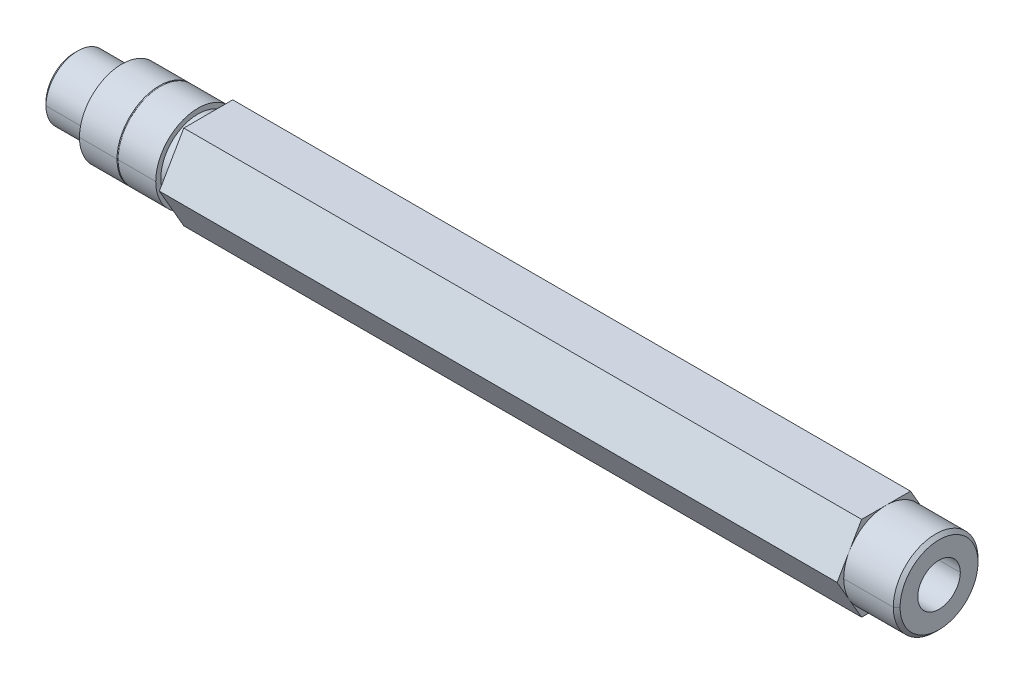
ISO-10303-21;
HEADER;
FILE_DESCRIPTION(('STEP AP214'),'2;1');
FILE_NAME('part.step','',(''),(''),'','','');
FILE_SCHEMA(('AUTOMOTIVE_DESIGN { 1 0 10303 214 1 1 1 1 }'));
ENDSEC;
DATA;
#1=APPLICATION_CONTEXT('core data for automotive mechanical design processes');
#2=APPLICATION_PROTOCOL_DEFINITION('international standard','automotive_design',2000,#1);
#3=PRODUCT_CONTEXT('',#1,'mechanical');
#4=PRODUCT('Part','Part','',(#3));
#5=PRODUCT_RELATED_PRODUCT_CATEGORY('part','',(#4));
#6=PRODUCT_DEFINITION_FORMATION('','',#4);
#7=PRODUCT_DEFINITION_CONTEXT('part definition',#1,'design');
#8=PRODUCT_DEFINITION('design','',#6,#7);
#9=PRODUCT_DEFINITION_SHAPE('','',#8);
#10=(LENGTH_UNIT() NAMED_UNIT(*) SI_UNIT(.MILLI.,.METRE.));
#11=(NAMED_UNIT(*) PLANE_ANGLE_UNIT() SI_UNIT($,.RADIAN.));
#12=(NAMED_UNIT(*) SI_UNIT($,.STERADIAN.) SOLID_ANGLE_UNIT());
#13=UNCERTAINTY_MEASURE_WITH_UNIT(LENGTH_MEASURE(1.E-05),#10,'distance_accuracy_value','');
#14=(GEOMETRIC_REPRESENTATION_CONTEXT(3) GLOBAL_UNCERTAINTY_ASSIGNED_CONTEXT((#13)) GLOBAL_UNIT_ASSIGNED_CONTEXT((#10,
#11,#12)) REPRESENTATION_CONTEXT('',''));
#15=CARTESIAN_POINT('',(0.,0.,0.));
#16=DIRECTION('',(0.,0.,1.));
#17=DIRECTION('',(1.,0.,0.));
#18=AXIS2_PLACEMENT_3D('',#15,#16,#17);
#19=CARTESIAN_POINT('',(18.542,0.,0.));
#20=DIRECTION('',(-1.,0.,0.));
#21=DIRECTION('',(0.,0.,1.));
#22=AXIS2_PLACEMENT_3D('',#19,#20,#21);
#23=CYLINDRICAL_SURFACE('',#22,6.35);
#24=DIRECTION('',(-1.,0.,0.));
#25=VECTOR('',#24,1.);
#26=CARTESIAN_POINT('',(18.542,0.,-6.35));
#27=LINE('',#26,#25);
#28=CARTESIAN_POINT('',(12.7381,0.,-6.35));
#29=VERTEX_POINT('',#28);
#30=CARTESIAN_POINT('',(7.112,0.,-6.35));
#31=VERTEX_POINT('',#30);
#32=EDGE_CURVE('E277',#29,#31,#27,.T.);
#33=ORIENTED_EDGE('',*,*,#32,.F.);
#34=CARTESIAN_POINT('',(12.7381,0.,0.));
#35=DIRECTION('',(1.,0.,0.));
#36=DIRECTION('',(0.,0.,-1.));
#37=AXIS2_PLACEMENT_3D('',#34,#35,#36);
#38=CIRCLE('',#37,6.35);
#39=CARTESIAN_POINT('',(12.7381,0.,6.35));
#40=VERTEX_POINT('',#39);
#41=EDGE_CURVE('E276',#40,#29,#38,.T.);
#42=ORIENTED_EDGE('',*,*,#41,.F.);
#43=DIRECTION('',(-1.,0.,0.));
#44=VECTOR('',#43,1.);
#45=CARTESIAN_POINT('',(18.542,0.,6.35));
#46=LINE('',#45,#44);
#47=CARTESIAN_POINT('',(7.112,0.,6.35));
#48=VERTEX_POINT('',#47);
#49=EDGE_CURVE('E262',#40,#48,#46,.T.);
#50=ORIENTED_EDGE('',*,*,#49,.T.);
#51=CARTESIAN_POINT('',(7.112,0.,0.));
#52=DIRECTION('',(1.,0.,0.));
#53=DIRECTION('',(0.,0.,-1.));
#54=AXIS2_PLACEMENT_3D('',#51,#52,#53);
#55=CIRCLE('',#54,6.35);
#56=EDGE_CURVE('E11',#48,#31,#55,.T.);
#57=ORIENTED_EDGE('',*,*,#56,.T.);
#58=EDGE_LOOP('',(#33,#42,#50,#57));
#59=FACE_BOUND('',#58,.T.);
#60=ADVANCED_FACE('F16',(#59),#23,.T.);
#61=CARTESIAN_POINT('',(7.112,0.,0.));
#62=DIRECTION('',(1.,0.,0.));
#63=DIRECTION('',(0.,1.,0.));
#64=AXIS2_PLACEMENT_3D('',#61,#62,#63);
#65=PLANE('',#64);
#66=CARTESIAN_POINT('',(7.112,0.,0.));
#67=DIRECTION('',(1.,0.,0.));
#68=DIRECTION('',(0.,0.,-1.));
#69=AXIS2_PLACEMENT_3D('',#66,#67,#68);
#70=CIRCLE('',#69,4.7625);
#71=CARTESIAN_POINT('',(7.112,0.,4.7625));
#72=VERTEX_POINT('',#71);
#73=CARTESIAN_POINT('',(7.112,0.,-4.7625));
#74=VERTEX_POINT('',#73);
#75=EDGE_CURVE('E26',#72,#74,#70,.T.);
#76=ORIENTED_EDGE('',*,*,#75,.T.);
#77=CARTESIAN_POINT('',(7.112,0.,0.));
#78=DIRECTION('',(1.,0.,0.));
#79=DIRECTION('',(0.,0.,-1.));
#80=AXIS2_PLACEMENT_3D('',#77,#78,#79);
#81=CIRCLE('',#80,4.7625);
#82=EDGE_CURVE('E273',#74,#72,#81,.T.);
#83=ORIENTED_EDGE('',*,*,#82,.T.);
#84=EDGE_LOOP('',(#76,#83));
#85=FACE_BOUND('',#84,.T.);
#86=ORIENTED_EDGE('',*,*,#56,.F.);
#87=CARTESIAN_POINT('',(7.112,0.,0.));
#88=DIRECTION('',(1.,0.,0.));
#89=DIRECTION('',(0.,0.,-1.));
#90=AXIS2_PLACEMENT_3D('',#87,#88,#89);
#91=CIRCLE('',#90,6.35);
#92=EDGE_CURVE('E270',#31,#48,#91,.T.);
#93=ORIENTED_EDGE('',*,*,#92,.F.);
#94=EDGE_LOOP('',(#86,#93));
#95=FACE_BOUND('',#94,.T.);
#96=ADVANCED_FACE('F629',(#85,#95),#65,.F.);
#97=CARTESIAN_POINT('',(7.112,0.,0.));
#98=DIRECTION('',(-1.,0.,0.));
#99=DIRECTION('',(0.,0.,1.));
#100=AXIS2_PLACEMENT_3D('',#97,#98,#99);
#101=CYLINDRICAL_SURFACE('',#100,4.7625);
#102=DIRECTION('',(-1.,0.,0.));
#103=VECTOR('',#102,1.);
#104=CARTESIAN_POINT('',(7.112,0.,-4.7625));
#105=LINE('',#104,#103);
#106=CARTESIAN_POINT('',(0.50800000000003,0.,-4.7625));
#107=VERTEX_POINT('',#106);
#108=EDGE_CURVE('E346',#74,#107,#105,.T.);
#109=ORIENTED_EDGE('',*,*,#108,.F.);
#110=ORIENTED_EDGE('',*,*,#75,.F.);
#111=DIRECTION('',(-1.,0.,0.));
#112=VECTOR('',#111,1.);
#113=CARTESIAN_POINT('',(7.112,0.,4.7625));
#114=LINE('',#113,#112);
#115=CARTESIAN_POINT('',(0.50800000000003,0.,4.7625));
#116=VERTEX_POINT('',#115);
#117=EDGE_CURVE('E345',#72,#116,#114,.T.);
#118=ORIENTED_EDGE('',*,*,#117,.T.);
#119=CARTESIAN_POINT('',(0.50800000000003,0.,0.));
#120=DIRECTION('',(1.,0.,0.));
#121=DIRECTION('',(0.,0.,-1.));
#122=AXIS2_PLACEMENT_3D('',#119,#120,#121);
#123=CIRCLE('',#122,4.7625);
#124=EDGE_CURVE('E311',#116,#107,#123,.T.);
#125=ORIENTED_EDGE('',*,*,#124,.T.);
#126=EDGE_LOOP('',(#109,#110,#118,#125));
#127=FACE_BOUND('',#126,.T.);
#128=ADVANCED_FACE('F635',(#127),#101,.T.);
#129=CARTESIAN_POINT('',(0.50800000000003,0.,0.));
#130=DIRECTION('',(1.,0.,0.));
#131=DIRECTION('',(0.,0.,-1.));
#132=AXIS2_PLACEMENT_3D('',#129,#130,#131);
#133=CONICAL_SURFACE('',#132,4.7625,0.785398163397452);
#134=DIRECTION('',(0.707106781186545,0.,0.70710678118655));
#135=VECTOR('',#134,1.);
#136=CARTESIAN_POINT('',(0.50800000000003,0.,4.7625));
#137=LINE('',#136,#135);
#138=CARTESIAN_POINT('',(0.,0.,4.2545));
#139=VERTEX_POINT('',#138);
#140=EDGE_CURVE('E324',#139,#116,#137,.T.);
#141=ORIENTED_EDGE('',*,*,#140,.F.);
#142=CARTESIAN_POINT('',(0.,0.,0.));
#143=DIRECTION('',(-1.,0.,0.));
#144=DIRECTION('',(0.,0.,-1.));
#145=AXIS2_PLACEMENT_3D('',#142,#143,#144);
#146=CIRCLE('',#145,4.2545);
#147=CARTESIAN_POINT('',(0.,0.,-4.2545));
#148=VERTEX_POINT('',#147);
#149=EDGE_CURVE('E378',#148,#139,#146,.T.);
#150=ORIENTED_EDGE('',*,*,#149,.F.);
#151=DIRECTION('',(0.707106781186545,0.,-0.70710678118655));
#152=VECTOR('',#151,1.);
#153=CARTESIAN_POINT('',(0.50800000000003,0.,-4.7625));
#154=LINE('',#153,#152);
#155=EDGE_CURVE('E327',#148,#107,#154,.T.);
#156=ORIENTED_EDGE('',*,*,#155,.T.);
#157=ORIENTED_EDGE('',*,*,#124,.F.);
#158=EDGE_LOOP('',(#141,#150,#156,#157));
#159=FACE_BOUND('',#158,.T.);
#160=ADVANCED_FACE('F644',(#159),#133,.T.);
#161=CARTESIAN_POINT('',(0.,0.,0.));
#162=DIRECTION('',(1.,0.,0.));
#163=DIRECTION('',(0.,1.,0.));
#164=AXIS2_PLACEMENT_3D('',#161,#162,#163);
#165=PLANE('',#164);
#166=CARTESIAN_POINT('',(0.,0.,0.));
#167=DIRECTION('',(-1.,0.,0.));
#168=DIRECTION('',(0.,0.,1.));
#169=AXIS2_PLACEMENT_3D('',#166,#167,#168);
#170=CIRCLE('',#169,3.1877);
#171=CARTESIAN_POINT('',(0.,0.,3.1877));
#172=VERTEX_POINT('',#171);
#173=CARTESIAN_POINT('',(0.,0.,-3.1877));
#174=VERTEX_POINT('',#173);
#175=EDGE_CURVE('E381',#172,#174,#170,.T.);
#176=ORIENTED_EDGE('',*,*,#175,.F.);
#177=CARTESIAN_POINT('',(0.,0.,0.));
#178=DIRECTION('',(-1.,0.,0.));
#179=DIRECTION('',(0.,0.,1.));
#180=AXIS2_PLACEMENT_3D('',#177,#178,#179);
#181=CIRCLE('',#180,3.1877);
#182=EDGE_CURVE('E426',#174,#172,#181,.T.);
#183=ORIENTED_EDGE('',*,*,#182,.F.);
#184=EDGE_LOOP('',(#176,#183));
#185=FACE_BOUND('',#184,.T.);
#186=ORIENTED_EDGE('',*,*,#149,.T.);
#187=CARTESIAN_POINT('',(0.,0.,0.));
#188=DIRECTION('',(-1.,0.,0.));
#189=DIRECTION('',(0.,0.,-1.));
#190=AXIS2_PLACEMENT_3D('',#187,#188,#189);
#191=CIRCLE('',#190,4.2545);
#192=EDGE_CURVE('E328',#139,#148,#191,.T.);
#193=ORIENTED_EDGE('',*,*,#192,.T.);
#194=EDGE_LOOP('',(#186,#193));
#195=FACE_BOUND('',#194,.T.);
#196=ADVANCED_FACE('F18',(#185,#195),#165,.F.);
#197=CARTESIAN_POINT('',(0.,0.,0.));
#198=DIRECTION('',(-1.,0.,0.));
#199=DIRECTION('',(0.,0.,1.));
#200=AXIS2_PLACEMENT_3D('',#197,#198,#199);
#201=CYLINDRICAL_SURFACE('',#200,3.1877);
#202=DIRECTION('',(-1.,0.,0.));
#203=VECTOR('',#202,1.);
#204=CARTESIAN_POINT('',(0.,0.,-3.1877));
#205=LINE('',#204,#203);
#206=CARTESIAN_POINT('',(12.7,0.,-3.1877));
#207=VERTEX_POINT('',#206);
#208=EDGE_CURVE('E422',#207,#174,#205,.T.);
#209=ORIENTED_EDGE('',*,*,#208,.F.);
#210=CARTESIAN_POINT('',(12.7,0.,0.));
#211=DIRECTION('',(-1.,0.,0.));
#212=DIRECTION('',(0.,0.,1.));
#213=AXIS2_PLACEMENT_3D('',#210,#211,#212);
#214=CIRCLE('',#213,3.1877);
#215=CARTESIAN_POINT('',(12.7,0.,3.1877));
#216=VERTEX_POINT('',#215);
#217=EDGE_CURVE('E593',#216,#207,#214,.T.);
#218=ORIENTED_EDGE('',*,*,#217,.F.);
#219=DIRECTION('',(-1.,0.,0.));
#220=VECTOR('',#219,1.);
#221=CARTESIAN_POINT('',(0.,0.,3.1877));
#222=LINE('',#221,#220);
#223=EDGE_CURVE('E433',#216,#172,#222,.T.);
#224=ORIENTED_EDGE('',*,*,#223,.T.);
#225=ORIENTED_EDGE('',*,*,#175,.T.);
#226=EDGE_LOOP('',(#209,#218,#224,#225));
#227=FACE_BOUND('',#226,.T.);
#228=ADVANCED_FACE('F603',(#227),#201,.F.);
#229=CARTESIAN_POINT('',(12.7,0.,0.));
#230=DIRECTION('',(-1.,0.,0.));
#231=DIRECTION('',(0.,0.,1.));
#232=AXIS2_PLACEMENT_3D('',#229,#230,#231);
#233=CONICAL_SURFACE('',#232,3.1877,1.02974425867665);
#234=DIRECTION('',(-0.515038074910055,0.,-0.857167300702112));
#235=VECTOR('',#234,1.);
#236=CARTESIAN_POINT('',(12.7,0.,-3.1877));
#237=LINE('',#236,#235);
#238=CARTESIAN_POINT('',(14.6153633952742,0.,0.));
#239=VERTEX_POINT('',#238);
#240=EDGE_CURVE('E418',#239,#207,#237,.T.);
#241=ORIENTED_EDGE('',*,*,#240,.F.);
#242=DIRECTION('',(-0.515038074910055,0.,0.857167300702112));
#243=VECTOR('',#242,1.);
#244=CARTESIAN_POINT('',(12.7,0.,3.1877));
#245=LINE('',#244,#243);
#246=EDGE_CURVE('E437',#239,#216,#245,.T.);
#247=ORIENTED_EDGE('',*,*,#246,.T.);
#248=ORIENTED_EDGE('',*,*,#217,.T.);
#249=EDGE_LOOP('',(#241,#247,#248));
#250=FACE_BOUND('',#249,.T.);
#251=ADVANCED_FACE('F614',(#250),#233,.F.);
#252=CARTESIAN_POINT('',(12.827,0.,0.));
#253=DIRECTION('',(-1.,0.,0.));
#254=DIRECTION('',(0.,0.,1.));
#255=AXIS2_PLACEMENT_3D('',#252,#253,#254);
#256=TOROIDAL_SURFACE('',#255,6.35,0.0889);
#257=CARTESIAN_POINT('',(12.827,0.,0.));
#258=DIRECTION('',(-1.,0.,0.));
#259=DIRECTION('',(0.,0.,1.));
#260=AXIS2_PLACEMENT_3D('',#257,#258,#259);
#261=CIRCLE('',#260,6.2611);
#262=CARTESIAN_POINT('',(12.827,0.,6.2611));
#263=VERTEX_POINT('',#262);
#264=CARTESIAN_POINT('',(12.827,0.,-6.2611));
#265=VERTEX_POINT('',#264);
#266=EDGE_CURVE('E297',#263,#265,#261,.T.);
#267=ORIENTED_EDGE('',*,*,#266,.F.);
#268=CARTESIAN_POINT('',(12.827,0.,6.35));
#269=DIRECTION('',(0.,-1.,0.));
#270=DIRECTION('',(0.,0.,-1.));
#271=AXIS2_PLACEMENT_3D('',#268,#269,#270);
#272=CIRCLE('',#271,0.0889);
#273=CARTESIAN_POINT('',(12.9159,0.,6.35));
#274=VERTEX_POINT('',#273);
#275=EDGE_CURVE('E452',#263,#274,#272,.T.);
#276=ORIENTED_EDGE('',*,*,#275,.T.);
#277=CARTESIAN_POINT('',(12.9159,0.,0.));
#278=DIRECTION('',(-1.,0.,0.));
#279=DIRECTION('',(0.,0.,1.));
#280=AXIS2_PLACEMENT_3D('',#277,#278,#279);
#281=CIRCLE('',#280,6.35);
#282=CARTESIAN_POINT('',(12.9159,0.,-6.35));
#283=VERTEX_POINT('',#282);
#284=EDGE_CURVE('E412',#274,#283,#281,.T.);
#285=ORIENTED_EDGE('',*,*,#284,.T.);
#286=CARTESIAN_POINT('',(12.827,0.,-6.35));
#287=DIRECTION('',(0.,1.,0.));
#288=DIRECTION('',(0.,0.,1.));
#289=AXIS2_PLACEMENT_3D('',#286,#287,#288);
#290=CIRCLE('',#289,0.0889);
#291=EDGE_CURVE('E413',#265,#283,#290,.T.);
#292=ORIENTED_EDGE('',*,*,#291,.F.);
#293=EDGE_LOOP('',(#267,#276,#285,#292));
#294=FACE_BOUND('',#293,.T.);
#295=ADVANCED_FACE('F616',(#294),#256,.F.);
#296=CARTESIAN_POINT('',(129.6035,0.,0.));
#297=DIRECTION('',(1.,0.,0.));
#298=DIRECTION('',(0.,0.,-1.));
#299=AXIS2_PLACEMENT_3D('',#296,#297,#298);
#300=CYLINDRICAL_SURFACE('',#299,3.1877);
#301=DIRECTION('',(1.,0.,0.));
#302=VECTOR('',#301,1.);
#303=CARTESIAN_POINT('',(129.6035,0.,3.1877));
#304=LINE('',#303,#302);
#305=CARTESIAN_POINT('',(116.9035,0.,3.1877));
#306=VERTEX_POINT('',#305);
#307=CARTESIAN_POINT('',(129.6035,0.,3.1877));
#308=VERTEX_POINT('',#307);
#309=EDGE_CURVE('E469',#306,#308,#304,.T.);
#310=ORIENTED_EDGE('',*,*,#309,.F.);
#311=CARTESIAN_POINT('',(116.9035,0.,0.));
#312=DIRECTION('',(1.,0.,0.));
#313=DIRECTION('',(0.,0.,-1.));
#314=AXIS2_PLACEMENT_3D('',#311,#312,#313);
#315=CIRCLE('',#314,3.1877);
#316=CARTESIAN_POINT('',(116.9035,0.,-3.1877));
#317=VERTEX_POINT('',#316);
#318=EDGE_CURVE('E20',#317,#306,#315,.T.);
#319=ORIENTED_EDGE('',*,*,#318,.F.);
#320=DIRECTION('',(1.,0.,0.));
#321=VECTOR('',#320,1.);
#322=CARTESIAN_POINT('',(129.6035,0.,-3.1877));
#323=LINE('',#322,#321);
#324=CARTESIAN_POINT('',(129.6035,0.,-3.1877));
#325=VERTEX_POINT('',#324);
#326=EDGE_CURVE('E481',#317,#325,#323,.T.);
#327=ORIENTED_EDGE('',*,*,#326,.T.);
#328=CARTESIAN_POINT('',(129.6035,0.,0.));
#329=DIRECTION('',(1.,0.,0.));
#330=DIRECTION('',(0.,0.,-1.));
#331=AXIS2_PLACEMENT_3D('',#328,#329,#330);
#332=CIRCLE('',#331,3.1877);
#333=EDGE_CURVE('E460',#325,#308,#332,.T.);
#334=ORIENTED_EDGE('',*,*,#333,.T.);
#335=EDGE_LOOP('',(#310,#319,#327,#334));
#336=FACE_BOUND('',#335,.T.);
#337=ADVANCED_FACE('F623',(#336),#300,.F.);
#338=CARTESIAN_POINT('',(116.9035,0.,0.));
#339=DIRECTION('',(1.,0.,0.));
#340=DIRECTION('',(0.,0.,-1.));
#341=AXIS2_PLACEMENT_3D('',#338,#339,#340);
#342=CONICAL_SURFACE('',#341,3.1877,1.02974425867665);
#343=DIRECTION('',(0.515038074910054,0.,0.857167300702112));
#344=VECTOR('',#343,1.);
#345=CARTESIAN_POINT('',(116.9035,0.,3.1877));
#346=LINE('',#345,#344);
#347=CARTESIAN_POINT('',(114.988136604726,0.,0.));
#348=VERTEX_POINT('',#347);
#349=EDGE_CURVE('E374',#348,#306,#346,.T.);
#350=ORIENTED_EDGE('',*,*,#349,.F.);
#351=DIRECTION('',(0.515038074910054,0.,-0.857167300702112));
#352=VECTOR('',#351,1.);
#353=CARTESIAN_POINT('',(116.9035,0.,-3.1877));
#354=LINE('',#353,#352);
#355=EDGE_CURVE('E485',#348,#317,#354,.T.);
#356=ORIENTED_EDGE('',*,*,#355,.T.);
#357=ORIENTED_EDGE('',*,*,#318,.T.);
#358=EDGE_LOOP('',(#350,#356,#357));
#359=FACE_BOUND('',#358,.T.);
#360=ADVANCED_FACE('F743',(#359),#342,.F.);
#361=CARTESIAN_POINT('',(129.6035,0.,0.));
#362=DIRECTION('',(-1.,0.,0.));
#363=DIRECTION('',(0.,0.,1.));
#364=AXIS2_PLACEMENT_3D('',#361,#362,#363);
#365=CONICAL_SURFACE('',#364,5.842,0.785398163397453);
#366=DIRECTION('',(-0.707106781186544,0.,-0.707106781186551));
#367=VECTOR('',#366,1.);
#368=CARTESIAN_POINT('',(129.6035,0.,-5.842));
#369=LINE('',#368,#367);
#370=CARTESIAN_POINT('',(129.6035,0.,-5.842));
#371=VERTEX_POINT('',#370);
#372=CARTESIAN_POINT('',(129.0955,0.,-6.35));
#373=VERTEX_POINT('',#372);
#374=EDGE_CURVE('E373',#371,#373,#369,.T.);
#375=ORIENTED_EDGE('',*,*,#374,.F.);
#376=CARTESIAN_POINT('',(129.6035,0.,0.));
#377=DIRECTION('',(1.,0.,0.));
#378=DIRECTION('',(0.,0.,-1.));
#379=AXIS2_PLACEMENT_3D('',#376,#377,#378);
#380=CIRCLE('',#379,5.842);
#381=CARTESIAN_POINT('',(129.6035,0.,5.842));
#382=VERTEX_POINT('',#381);
#383=EDGE_CURVE('E463',#382,#371,#380,.T.);
#384=ORIENTED_EDGE('',*,*,#383,.F.);
#385=DIRECTION('',(-0.707106781186544,0.,0.707106781186551));
#386=VECTOR('',#385,1.);
#387=CARTESIAN_POINT('',(129.6035,0.,5.842));
#388=LINE('',#387,#386);
#389=CARTESIAN_POINT('',(129.0955,0.,6.35));
#390=VERTEX_POINT('',#389);
#391=EDGE_CURVE('E338',#382,#390,#388,.T.);
#392=ORIENTED_EDGE('',*,*,#391,.T.);
#393=CARTESIAN_POINT('',(129.0955,0.,0.));
#394=DIRECTION('',(-1.,0.,0.));
#395=DIRECTION('',(0.,0.,-1.));
#396=AXIS2_PLACEMENT_3D('',#393,#394,#395);
#397=CIRCLE('',#396,6.35);
#398=EDGE_CURVE('E305',#373,#390,#397,.T.);
#399=ORIENTED_EDGE('',*,*,#398,.F.);
#400=EDGE_LOOP('',(#375,#384,#392,#399));
#401=FACE_BOUND('',#400,.T.);
#402=ADVANCED_FACE('F739',(#401),#365,.T.);
#403=CARTESIAN_POINT('',(129.6035,0.,0.));
#404=DIRECTION('',(1.,0.,0.));
#405=DIRECTION('',(0.,1.,0.));
#406=AXIS2_PLACEMENT_3D('',#403,#404,#405);
#407=PLANE('',#406);
#408=ORIENTED_EDGE('',*,*,#333,.F.);
#409=CARTESIAN_POINT('',(129.6035,0.,0.));
#410=DIRECTION('',(1.,0.,0.));
#411=DIRECTION('',(0.,0.,-1.));
#412=AXIS2_PLACEMENT_3D('',#409,#410,#411);
#413=CIRCLE('',#412,3.1877);
#414=EDGE_CURVE('E477',#308,#325,#413,.T.);
#415=ORIENTED_EDGE('',*,*,#414,.F.);
#416=EDGE_LOOP('',(#408,#415));
#417=FACE_BOUND('',#416,.T.);
#418=ORIENTED_EDGE('',*,*,#383,.T.);
#419=CARTESIAN_POINT('',(129.6035,0.,0.));
#420=DIRECTION('',(1.,0.,0.));
#421=DIRECTION('',(0.,0.,-1.));
#422=AXIS2_PLACEMENT_3D('',#419,#420,#421);
#423=CIRCLE('',#422,5.842);
#424=EDGE_CURVE('E369',#371,#382,#423,.T.);
#425=ORIENTED_EDGE('',*,*,#424,.T.);
#426=EDGE_LOOP('',(#418,#425));
#427=FACE_BOUND('',#426,.T.);
#428=ADVANCED_FACE('F742',(#417,#427),#407,.T.);
#429=CARTESIAN_POINT('',(129.6035,0.,0.));
#430=DIRECTION('',(-1.,0.,0.));
#431=DIRECTION('',(0.,0.,1.));
#432=AXIS2_PLACEMENT_3D('',#429,#430,#431);
#433=CYLINDRICAL_SURFACE('',#432,6.35);
#434=DIRECTION('',(-1.,0.,0.));
#435=VECTOR('',#434,1.);
#436=CARTESIAN_POINT('',(129.6035,0.,-6.35));
#437=LINE('',#436,#435);
#438=CARTESIAN_POINT('',(121.666,0.,-6.35));
#439=VERTEX_POINT('',#438);
#440=EDGE_CURVE('E333',#373,#439,#437,.T.);
#441=ORIENTED_EDGE('',*,*,#440,.F.);
#442=ORIENTED_EDGE('',*,*,#398,.T.);
#443=DIRECTION('',(-1.,0.,0.));
#444=VECTOR('',#443,1.);
#445=CARTESIAN_POINT('',(129.6035,0.,6.35));
#446=LINE('',#445,#444);
#447=CARTESIAN_POINT('',(121.666,0.,6.35));
#448=VERTEX_POINT('',#447);
#449=EDGE_CURVE('E323',#390,#448,#446,.T.);
#450=ORIENTED_EDGE('',*,*,#449,.T.);
#451=CARTESIAN_POINT('',(121.666,0.,0.));
#452=DIRECTION('',(1.,0.,0.));
#453=DIRECTION('',(0.,0.,-1.));
#454=AXIS2_PLACEMENT_3D('',#451,#452,#453);
#455=CIRCLE('',#454,6.35);
#456=CARTESIAN_POINT('',(121.666,-3.175,5.49926131403118));
#457=VERTEX_POINT('',#456);
#458=EDGE_CURVE('E552',#448,#457,#455,.T.);
#459=ORIENTED_EDGE('',*,*,#458,.T.);
#460=CARTESIAN_POINT('',(121.666,0.,0.));
#461=DIRECTION('',(1.,0.,0.));
#462=DIRECTION('',(0.,0.,-1.));
#463=AXIS2_PLACEMENT_3D('',#460,#461,#462);
#464=CIRCLE('',#463,6.35);
#465=CARTESIAN_POINT('',(121.666,-6.35,0.));
#466=VERTEX_POINT('',#465);
#467=EDGE_CURVE('E556',#457,#466,#464,.T.);
#468=ORIENTED_EDGE('',*,*,#467,.T.);
#469=CARTESIAN_POINT('',(121.666,0.,0.));
#470=DIRECTION('',(1.,0.,0.));
#471=DIRECTION('',(0.,0.,-1.));
#472=AXIS2_PLACEMENT_3D('',#469,#470,#471);
#473=CIRCLE('',#472,6.35);
#474=CARTESIAN_POINT('',(121.666,-3.175,-5.49926131403119));
#475=VERTEX_POINT('',#474);
#476=EDGE_CURVE('E312',#466,#475,#473,.T.);
#477=ORIENTED_EDGE('',*,*,#476,.T.);
#478=CARTESIAN_POINT('',(121.666,0.,0.));
#479=DIRECTION('',(1.,0.,0.));
#480=DIRECTION('',(0.,0.,-1.));
#481=AXIS2_PLACEMENT_3D('',#478,#479,#480);
#482=CIRCLE('',#481,6.35);
#483=EDGE_CURVE('E497',#475,#439,#482,.T.);
#484=ORIENTED_EDGE('',*,*,#483,.T.);
#485=EDGE_LOOP('',(#441,#442,#450,#459,#468,#477,#484));
#486=FACE_BOUND('',#485,.T.);
#487=ADVANCED_FACE('F750',(#486),#433,.T.);
#488=CARTESIAN_POINT('',(121.666,0.,0.));
#489=DIRECTION('',(1.,0.,0.));
#490=DIRECTION('',(0.,1.,0.));
#491=AXIS2_PLACEMENT_3D('',#488,#489,#490);
#492=PLANE('',#491);
#493=ORIENTED_EDGE('',*,*,#483,.F.);
#494=DIRECTION('',(0.,0.866025403784439,-0.5));
#495=VECTOR('',#494,1.);
#496=CARTESIAN_POINT('',(121.666,-6.35,-3.66617420935412));
#497=LINE('',#496,#495);
#498=CARTESIAN_POINT('',(121.666,0.,-7.33234841870824));
#499=VERTEX_POINT('',#498);
#500=EDGE_CURVE('E394',#475,#499,#497,.T.);
#501=ORIENTED_EDGE('',*,*,#500,.T.);
#502=DIRECTION('',(0.,0.866025403784439,0.5));
#503=VECTOR('',#502,1.);
#504=CARTESIAN_POINT('',(121.666,0.,-7.33234841870824));
#505=LINE('',#504,#503);
#506=CARTESIAN_POINT('',(121.666,3.175,-5.49926131403118));
#507=VERTEX_POINT('',#506);
#508=EDGE_CURVE('E40',#499,#507,#505,.T.);
#509=ORIENTED_EDGE('',*,*,#508,.T.);
#510=CARTESIAN_POINT('',(121.666,0.,0.));
#511=DIRECTION('',(1.,0.,0.));
#512=DIRECTION('',(0.,0.,-1.));
#513=AXIS2_PLACEMENT_3D('',#510,#511,#512);
#514=CIRCLE('',#513,6.35);
#515=EDGE_CURVE('E337',#439,#507,#514,.T.);
#516=ORIENTED_EDGE('',*,*,#515,.F.);
#517=EDGE_LOOP('',(#493,#501,#509,#516));
#518=FACE_BOUND('',#517,.T.);
#519=ADVANCED_FACE('F747',(#518),#492,.T.);
#520=CARTESIAN_POINT('',(121.666,-6.35,3.66617420935412));
#521=DIRECTION('',(0.,1.,0.));
#522=DIRECTION('',(0.,0.,-1.));
#523=AXIS2_PLACEMENT_3D('',#520,#521,#522);
#524=PLANE('',#523);
#525=DIRECTION('',(0.,0.,-1.));
#526=VECTOR('',#525,1.);
#527=CARTESIAN_POINT('',(20.066,-6.35,3.66617420935412));
#528=LINE('',#527,#526);
#529=CARTESIAN_POINT('',(20.066,-6.35,3.66617420935412));
#530=VERTEX_POINT('',#529);
#531=CARTESIAN_POINT('',(20.066,-6.35,-3.66617420935412));
#532=VERTEX_POINT('',#531);
#533=EDGE_CURVE('E400',#530,#532,#528,.T.);
#534=ORIENTED_EDGE('',*,*,#533,.T.);
#535=DIRECTION('',(-1.,0.,0.));
#536=VECTOR('',#535,1.);
#537=CARTESIAN_POINT('',(121.666,-6.35,-3.66617420935412));
#538=LINE('',#537,#536);
#539=CARTESIAN_POINT('',(121.666,-6.35,-3.66617420935412));
#540=VERTEX_POINT('',#539);
#541=EDGE_CURVE('E391',#540,#532,#538,.T.);
#542=ORIENTED_EDGE('',*,*,#541,.F.);
#543=DIRECTION('',(0.,0.,-1.));
#544=VECTOR('',#543,1.);
#545=CARTESIAN_POINT('',(121.666,-6.35,3.66617420935412));
#546=LINE('',#545,#544);
#547=EDGE_CURVE('E316',#466,#540,#546,.T.);
#548=ORIENTED_EDGE('',*,*,#547,.F.);
#549=DIRECTION('',(0.,0.,-1.));
#550=VECTOR('',#549,1.);
#551=CARTESIAN_POINT('',(121.666,-6.35,3.66617420935412));
#552=LINE('',#551,#550);
#553=CARTESIAN_POINT('',(121.666,-6.35,3.66617420935412));
#554=VERTEX_POINT('',#553);
#555=EDGE_CURVE('E317',#554,#466,#552,.T.);
#556=ORIENTED_EDGE('',*,*,#555,.F.);
#557=DIRECTION('',(-1.,0.,0.));
#558=VECTOR('',#557,1.);
#559=CARTESIAN_POINT('',(121.666,-6.35,3.66617420935412));
#560=LINE('',#559,#558);
#561=EDGE_CURVE('E500',#554,#530,#560,.T.);
#562=ORIENTED_EDGE('',*,*,#561,.T.);
#563=EDGE_LOOP('',(#534,#542,#548,#556,#562));
#564=FACE_BOUND('',#563,.T.);
#565=ADVANCED_FACE('F737',(#564),#524,.F.);
#566=CARTESIAN_POINT('',(121.666,0.,7.33234841870824));
#567=DIRECTION('',(0.,0.5,-0.866025403784438));
#568=DIRECTION('',(-1.,0.,0.));
#569=AXIS2_PLACEMENT_3D('',#566,#567,#568);
#570=PLANE('',#569);
#571=DIRECTION('',(0.,-0.866025403784439,-0.5));
#572=VECTOR('',#571,1.);
#573=CARTESIAN_POINT('',(20.066,0.,7.33234841870824));
#574=LINE('',#573,#572);
#575=CARTESIAN_POINT('',(20.066,0.,7.33234841870824));
#576=VERTEX_POINT('',#575);
#577=EDGE_CURVE('E395',#576,#530,#574,.T.);
#578=ORIENTED_EDGE('',*,*,#577,.T.);
#579=ORIENTED_EDGE('',*,*,#561,.F.);
#580=DIRECTION('',(0.,-0.866025403784439,-0.5));
#581=VECTOR('',#580,1.);
#582=CARTESIAN_POINT('',(121.666,0.,7.33234841870824));
#583=LINE('',#582,#581);
#584=EDGE_CURVE('E447',#457,#554,#583,.T.);
#585=ORIENTED_EDGE('',*,*,#584,.F.);
#586=DIRECTION('',(0.,-0.866025403784439,-0.5));
#587=VECTOR('',#586,1.);
#588=CARTESIAN_POINT('',(121.666,0.,7.33234841870824));
#589=LINE('',#588,#587);
#590=CARTESIAN_POINT('',(121.666,0.,7.33234841870824));
#591=VERTEX_POINT('',#590);
#592=EDGE_CURVE('E548',#591,#457,#589,.T.);
#593=ORIENTED_EDGE('',*,*,#592,.F.);
#594=DIRECTION('',(-1.,0.,0.));
#595=VECTOR('',#594,1.);
#596=CARTESIAN_POINT('',(121.666,0.,7.33234841870824));
#597=LINE('',#596,#595);
#598=EDGE_CURVE('E574',#591,#576,#597,.T.);
#599=ORIENTED_EDGE('',*,*,#598,.T.);
#600=EDGE_LOOP('',(#578,#579,#585,#593,#599));
#601=FACE_BOUND('',#600,.T.);
#602=ADVANCED_FACE('F733',(#601),#570,.F.);
#603=CARTESIAN_POINT('',(121.666,6.35,3.66617420935412));
#604=DIRECTION('',(0.,-0.5,-0.866025403784439));
#605=DIRECTION('',(0.,-0.866025403784439,0.5));
#606=AXIS2_PLACEMENT_3D('',#603,#604,#605);
#607=PLANE('',#606);
#608=DIRECTION('',(0.,-0.866025403784439,0.5));
#609=VECTOR('',#608,1.);
#610=CARTESIAN_POINT('',(20.066,6.35,3.66617420935412));
#611=LINE('',#610,#609);
#612=CARTESIAN_POINT('',(20.066,6.35,3.66617420935412));
#613=VERTEX_POINT('',#612);
#614=EDGE_CURVE('E399',#613,#576,#611,.T.);
#615=ORIENTED_EDGE('',*,*,#614,.T.);
#616=ORIENTED_EDGE('',*,*,#598,.F.);
#617=DIRECTION('',(0.,-0.866025403784439,0.5));
#618=VECTOR('',#617,1.);
#619=CARTESIAN_POINT('',(121.666,6.35,3.66617420935412));
#620=LINE('',#619,#618);
#621=CARTESIAN_POINT('',(121.666,3.175,5.49926131403119));
#622=VERTEX_POINT('',#621);
#623=EDGE_CURVE('E385',#622,#591,#620,.T.);
#624=ORIENTED_EDGE('',*,*,#623,.F.);
#625=DIRECTION('',(0.,-0.866025403784439,0.5));
#626=VECTOR('',#625,1.);
#627=CARTESIAN_POINT('',(121.666,6.35,3.66617420935412));
#628=LINE('',#627,#626);
#629=CARTESIAN_POINT('',(121.666,6.35,3.66617420935412));
#630=VERTEX_POINT('',#629);
#631=EDGE_CURVE('E382',#630,#622,#628,.T.);
#632=ORIENTED_EDGE('',*,*,#631,.F.);
#633=DIRECTION('',(-1.,0.,0.));
#634=VECTOR('',#633,1.);
#635=CARTESIAN_POINT('',(121.666,6.35,3.66617420935412));
#636=LINE('',#635,#634);
#637=EDGE_CURVE('E332',#630,#613,#636,.T.);
#638=ORIENTED_EDGE('',*,*,#637,.T.);
#639=EDGE_LOOP('',(#615,#616,#624,#632,#638));
#640=FACE_BOUND('',#639,.T.);
#641=ADVANCED_FACE('F729',(#640),#607,.F.);
#642=CARTESIAN_POINT('',(121.666,6.35,-3.66617420935412));
#643=DIRECTION('',(0.,-1.,0.));
#644=DIRECTION('',(0.,0.,-1.));
#645=AXIS2_PLACEMENT_3D('',#642,#643,#644);
#646=PLANE('',#645);
#647=DIRECTION('',(0.,0.,1.));
#648=VECTOR('',#647,1.);
#649=CARTESIAN_POINT('',(20.066,6.35,-3.66617420935412));
#650=LINE('',#649,#648);
#651=CARTESIAN_POINT('',(20.066,6.35,-3.66617420935412));
#652=VERTEX_POINT('',#651);
#653=EDGE_CURVE('E578',#652,#613,#650,.T.);
#654=ORIENTED_EDGE('',*,*,#653,.T.);
#655=ORIENTED_EDGE('',*,*,#637,.F.);
#656=DIRECTION('',(0.,0.,1.));
#657=VECTOR('',#656,1.);
#658=CARTESIAN_POINT('',(121.666,6.35,-3.66617420935412));
#659=LINE('',#658,#657);
#660=CARTESIAN_POINT('',(121.666,6.35,0.));
#661=VERTEX_POINT('',#660);
#662=EDGE_CURVE('E386',#661,#630,#659,.T.);
#663=ORIENTED_EDGE('',*,*,#662,.F.);
#664=DIRECTION('',(0.,0.,1.));
#665=VECTOR('',#664,1.);
#666=CARTESIAN_POINT('',(121.666,6.35,-3.66617420935412));
#667=LINE('',#666,#665);
#668=CARTESIAN_POINT('',(121.666,6.35,-3.66617420935412));
#669=VERTEX_POINT('',#668);
#670=EDGE_CURVE('E536',#669,#661,#667,.T.);
#671=ORIENTED_EDGE('',*,*,#670,.F.);
#672=DIRECTION('',(-1.,0.,0.));
#673=VECTOR('',#672,1.);
#674=CARTESIAN_POINT('',(121.666,6.35,-3.66617420935412));
#675=LINE('',#674,#673);
#676=EDGE_CURVE('E51',#669,#652,#675,.T.);
#677=ORIENTED_EDGE('',*,*,#676,.T.);
#678=EDGE_LOOP('',(#654,#655,#663,#671,#677));
#679=FACE_BOUND('',#678,.T.);
#680=ADVANCED_FACE('F727',(#679),#646,.F.);
#681=CARTESIAN_POINT('',(121.666,0.,-7.33234841870824));
#682=DIRECTION('',(0.,-0.5,0.866025403784438));
#683=DIRECTION('',(-1.,0.,0.));
#684=AXIS2_PLACEMENT_3D('',#681,#682,#683);
#685=PLANE('',#684);
#686=DIRECTION('',(0.,0.866025403784439,0.5));
#687=VECTOR('',#686,1.);
#688=CARTESIAN_POINT('',(20.066,0.,-7.33234841870824));
#689=LINE('',#688,#687);
#690=CARTESIAN_POINT('',(20.066,0.,-7.33234841870824));
#691=VERTEX_POINT('',#690);
#692=EDGE_CURVE('E581',#691,#652,#689,.T.);
#693=ORIENTED_EDGE('',*,*,#692,.T.);
#694=ORIENTED_EDGE('',*,*,#676,.F.);
#695=DIRECTION('',(0.,0.866025403784439,0.5));
#696=VECTOR('',#695,1.);
#697=CARTESIAN_POINT('',(121.666,0.,-7.33234841870824));
#698=LINE('',#697,#696);
#699=EDGE_CURVE('E532',#507,#669,#698,.T.);
#700=ORIENTED_EDGE('',*,*,#699,.F.);
#701=ORIENTED_EDGE('',*,*,#508,.F.);
#702=DIRECTION('',(-1.,0.,0.));
#703=VECTOR('',#702,1.);
#704=CARTESIAN_POINT('',(121.666,0.,-7.33234841870824));
#705=LINE('',#704,#703);
#706=EDGE_CURVE('E584',#499,#691,#705,.T.);
#707=ORIENTED_EDGE('',*,*,#706,.T.);
#708=EDGE_LOOP('',(#693,#694,#700,#701,#707));
#709=FACE_BOUND('',#708,.T.);
#710=ADVANCED_FACE('F723',(#709),#685,.F.);
#711=CARTESIAN_POINT('',(121.666,-6.35,-3.66617420935412));
#712=DIRECTION('',(0.,0.5,0.866025403784439));
#713=DIRECTION('',(1.,0.,0.));
#714=AXIS2_PLACEMENT_3D('',#711,#712,#713);
#715=PLANE('',#714);
#716=DIRECTION('',(0.,0.866025403784439,-0.5));
#717=VECTOR('',#716,1.);
#718=CARTESIAN_POINT('',(20.066,-6.35,-3.66617420935412));
#719=LINE('',#718,#717);
#720=EDGE_CURVE('E349',#532,#691,#719,.T.);
#721=ORIENTED_EDGE('',*,*,#720,.T.);
#722=ORIENTED_EDGE('',*,*,#706,.F.);
#723=ORIENTED_EDGE('',*,*,#500,.F.);
#724=DIRECTION('',(0.,0.866025403784439,-0.5));
#725=VECTOR('',#724,1.);
#726=CARTESIAN_POINT('',(121.666,-6.35,-3.66617420935412));
#727=LINE('',#726,#725);
#728=EDGE_CURVE('E473',#540,#475,#727,.T.);
#729=ORIENTED_EDGE('',*,*,#728,.F.);
#730=ORIENTED_EDGE('',*,*,#541,.T.);
#731=EDGE_LOOP('',(#721,#722,#723,#729,#730));
#732=FACE_BOUND('',#731,.T.);
#733=ADVANCED_FACE('F719',(#732),#715,.F.);
#734=CARTESIAN_POINT('',(20.066,0.,0.));
#735=DIRECTION('',(1.,0.,0.));
#736=DIRECTION('',(0.,1.,0.));
#737=AXIS2_PLACEMENT_3D('',#734,#735,#736);
#738=PLANE('',#737);
#739=CARTESIAN_POINT('',(20.066,0.,0.));
#740=DIRECTION('',(1.,0.,0.));
#741=DIRECTION('',(0.,0.,-1.));
#742=AXIS2_PLACEMENT_3D('',#739,#740,#741);
#743=CIRCLE('',#742,5.588);
#744=CARTESIAN_POINT('',(20.066,0.,5.588));
#745=VERTEX_POINT('',#744);
#746=CARTESIAN_POINT('',(20.066,0.,-5.588));
#747=VERTEX_POINT('',#746);
#748=EDGE_CURVE('E347',#745,#747,#743,.T.);
#749=ORIENTED_EDGE('',*,*,#748,.T.);
#750=CARTESIAN_POINT('',(20.066,0.,0.));
#751=DIRECTION('',(1.,0.,0.));
#752=DIRECTION('',(0.,0.,-1.));
#753=AXIS2_PLACEMENT_3D('',#750,#751,#752);
#754=CIRCLE('',#753,5.588);
#755=EDGE_CURVE('E318',#747,#745,#754,.T.);
#756=ORIENTED_EDGE('',*,*,#755,.T.);
#757=EDGE_LOOP('',(#749,#756));
#758=FACE_BOUND('',#757,.T.);
#759=ORIENTED_EDGE('',*,*,#720,.F.);
#760=ORIENTED_EDGE('',*,*,#533,.F.);
#761=ORIENTED_EDGE('',*,*,#577,.F.);
#762=ORIENTED_EDGE('',*,*,#614,.F.);
#763=ORIENTED_EDGE('',*,*,#653,.F.);
#764=ORIENTED_EDGE('',*,*,#692,.F.);
#765=EDGE_LOOP('',(#759,#760,#761,#762,#763,#764));
#766=FACE_BOUND('',#765,.T.);
#767=ADVANCED_FACE('F683',(#758,#766),#738,.F.);
#768=CARTESIAN_POINT('',(20.066,0.,0.));
#769=DIRECTION('',(-1.,0.,0.));
#770=DIRECTION('',(0.,0.,1.));
#771=AXIS2_PLACEMENT_3D('',#768,#769,#770);
#772=CYLINDRICAL_SURFACE('',#771,5.588);
#773=DIRECTION('',(-1.,0.,0.));
#774=VECTOR('',#773,1.);
#775=CARTESIAN_POINT('',(20.066,0.,-5.588));
#776=LINE('',#775,#774);
#777=CARTESIAN_POINT('',(18.542,0.,-5.588));
#778=VERTEX_POINT('',#777);
#779=EDGE_CURVE('E322',#747,#778,#776,.T.);
#780=ORIENTED_EDGE('',*,*,#779,.F.);
#781=ORIENTED_EDGE('',*,*,#748,.F.);
#782=DIRECTION('',(-1.,0.,0.));
#783=VECTOR('',#782,1.);
#784=CARTESIAN_POINT('',(20.066,0.,5.588));
#785=LINE('',#784,#783);
#786=CARTESIAN_POINT('',(18.542,0.,5.588));
#787=VERTEX_POINT('',#786);
#788=EDGE_CURVE('E352',#745,#787,#785,.T.);
#789=ORIENTED_EDGE('',*,*,#788,.T.);
#790=CARTESIAN_POINT('',(18.542,0.,0.));
#791=DIRECTION('',(1.,0.,0.));
#792=DIRECTION('',(0.,0.,-1.));
#793=AXIS2_PLACEMENT_3D('',#790,#791,#792);
#794=CIRCLE('',#793,5.588);
#795=EDGE_CURVE('E350',#787,#778,#794,.T.);
#796=ORIENTED_EDGE('',*,*,#795,.T.);
#797=EDGE_LOOP('',(#780,#781,#789,#796));
#798=FACE_BOUND('',#797,.T.);
#799=ADVANCED_FACE('F679',(#798),#772,.T.);
#800=CARTESIAN_POINT('',(18.542,0.,0.));
#801=DIRECTION('',(1.,0.,0.));
#802=DIRECTION('',(0.,1.,0.));
#803=AXIS2_PLACEMENT_3D('',#800,#801,#802);
#804=PLANE('',#803);
#805=ORIENTED_EDGE('',*,*,#795,.F.);
#806=CARTESIAN_POINT('',(18.542,0.,0.));
#807=DIRECTION('',(1.,0.,0.));
#808=DIRECTION('',(0.,0.,-1.));
#809=AXIS2_PLACEMENT_3D('',#806,#807,#808);
#810=CIRCLE('',#809,5.588);
#811=EDGE_CURVE('E357',#778,#787,#810,.T.);
#812=ORIENTED_EDGE('',*,*,#811,.F.);
#813=EDGE_LOOP('',(#805,#812));
#814=FACE_BOUND('',#813,.T.);
#815=CARTESIAN_POINT('',(18.542,0.,0.));
#816=DIRECTION('',(1.,0.,0.));
#817=DIRECTION('',(0.,0.,-1.));
#818=AXIS2_PLACEMENT_3D('',#815,#816,#817);
#819=CIRCLE('',#818,6.35);
#820=CARTESIAN_POINT('',(18.542,0.,6.35));
#821=VERTEX_POINT('',#820);
#822=CARTESIAN_POINT('',(18.542,0.,-6.35));
#823=VERTEX_POINT('',#822);
#824=EDGE_CURVE('E529',#821,#823,#819,.T.);
#825=ORIENTED_EDGE('',*,*,#824,.T.);
#826=CARTESIAN_POINT('',(18.542,0.,0.));
#827=DIRECTION('',(1.,0.,0.));
#828=DIRECTION('',(0.,0.,-1.));
#829=AXIS2_PLACEMENT_3D('',#826,#827,#828);
#830=CIRCLE('',#829,6.35);
#831=EDGE_CURVE('E356',#823,#821,#830,.T.);
#832=ORIENTED_EDGE('',*,*,#831,.T.);
#833=EDGE_LOOP('',(#825,#832));
#834=FACE_BOUND('',#833,.T.);
#835=ADVANCED_FACE('F682',(#814,#834),#804,.T.);
#836=CARTESIAN_POINT('',(121.666,0.,0.));
#837=DIRECTION('',(1.,0.,0.));
#838=DIRECTION('',(0.,1.,0.));
#839=AXIS2_PLACEMENT_3D('',#836,#837,#838);
#840=PLANE('',#839);
#841=ORIENTED_EDGE('',*,*,#476,.F.);
#842=ORIENTED_EDGE('',*,*,#547,.T.);
#843=ORIENTED_EDGE('',*,*,#728,.T.);
#844=EDGE_LOOP('',(#841,#842,#843));
#845=FACE_BOUND('',#844,.T.);
#846=ADVANCED_FACE('F709',(#845),#840,.T.);
#847=CARTESIAN_POINT('',(121.666,0.,0.));
#848=DIRECTION('',(1.,0.,0.));
#849=DIRECTION('',(0.,1.,0.));
#850=AXIS2_PLACEMENT_3D('',#847,#848,#849);
#851=PLANE('',#850);
#852=ORIENTED_EDGE('',*,*,#467,.F.);
#853=ORIENTED_EDGE('',*,*,#584,.T.);
#854=ORIENTED_EDGE('',*,*,#555,.T.);
#855=EDGE_LOOP('',(#852,#853,#854));
#856=FACE_BOUND('',#855,.T.);
#857=ADVANCED_FACE('F705',(#856),#851,.T.);
#858=CARTESIAN_POINT('',(121.666,0.,0.));
#859=DIRECTION('',(1.,0.,0.));
#860=DIRECTION('',(0.,1.,0.));
#861=AXIS2_PLACEMENT_3D('',#858,#859,#860);
#862=PLANE('',#861);
#863=CARTESIAN_POINT('',(121.666,0.,0.));
#864=DIRECTION('',(1.,0.,0.));
#865=DIRECTION('',(0.,0.,-1.));
#866=AXIS2_PLACEMENT_3D('',#863,#864,#865);
#867=CIRCLE('',#866,6.35);
#868=EDGE_CURVE('E451',#622,#448,#867,.T.);
#869=ORIENTED_EDGE('',*,*,#868,.F.);
#870=ORIENTED_EDGE('',*,*,#623,.T.);
#871=ORIENTED_EDGE('',*,*,#592,.T.);
#872=ORIENTED_EDGE('',*,*,#458,.F.);
#873=EDGE_LOOP('',(#869,#870,#871,#872));
#874=FACE_BOUND('',#873,.T.);
#875=ADVANCED_FACE('F652',(#874),#862,.T.);
#876=CARTESIAN_POINT('',(121.666,0.,0.));
#877=DIRECTION('',(1.,0.,0.));
#878=DIRECTION('',(0.,1.,0.));
#879=AXIS2_PLACEMENT_3D('',#876,#877,#878);
#880=PLANE('',#879);
#881=CARTESIAN_POINT('',(121.666,0.,0.));
#882=DIRECTION('',(1.,0.,0.));
#883=DIRECTION('',(0.,0.,-1.));
#884=AXIS2_PLACEMENT_3D('',#881,#882,#883);
#885=CIRCLE('',#884,6.35);
#886=EDGE_CURVE('E514',#661,#622,#885,.T.);
#887=ORIENTED_EDGE('',*,*,#886,.F.);
#888=ORIENTED_EDGE('',*,*,#662,.T.);
#889=ORIENTED_EDGE('',*,*,#631,.T.);
#890=EDGE_LOOP('',(#887,#888,#889));
#891=FACE_BOUND('',#890,.T.);
#892=ADVANCED_FACE('F648',(#891),#880,.T.);
#893=CARTESIAN_POINT('',(121.666,0.,0.));
#894=DIRECTION('',(1.,0.,0.));
#895=DIRECTION('',(0.,1.,0.));
#896=AXIS2_PLACEMENT_3D('',#893,#894,#895);
#897=PLANE('',#896);
#898=CARTESIAN_POINT('',(121.666,0.,0.));
#899=DIRECTION('',(1.,0.,0.));
#900=DIRECTION('',(0.,0.,-1.));
#901=AXIS2_PLACEMENT_3D('',#898,#899,#900);
#902=CIRCLE('',#901,6.35);
#903=EDGE_CURVE('E363',#507,#661,#902,.T.);
#904=ORIENTED_EDGE('',*,*,#903,.F.);
#905=ORIENTED_EDGE('',*,*,#699,.T.);
#906=ORIENTED_EDGE('',*,*,#670,.T.);
#907=EDGE_LOOP('',(#904,#905,#906));
#908=FACE_BOUND('',#907,.T.);
#909=ADVANCED_FACE('F651',(#908),#897,.T.);
#910=CARTESIAN_POINT('',(18.542,0.,0.));
#911=DIRECTION('',(-1.,0.,0.));
#912=DIRECTION('',(0.,0.,1.));
#913=AXIS2_PLACEMENT_3D('',#910,#911,#912);
#914=CYLINDRICAL_SURFACE('',#913,6.35);
#915=DIRECTION('',(-1.,0.,0.));
#916=VECTOR('',#915,1.);
#917=CARTESIAN_POINT('',(18.542,0.,-6.35));
#918=LINE('',#917,#916);
#919=EDGE_CURVE('E408',#823,#283,#918,.T.);
#920=ORIENTED_EDGE('',*,*,#919,.F.);
#921=ORIENTED_EDGE('',*,*,#824,.F.);
#922=DIRECTION('',(-1.,0.,0.));
#923=VECTOR('',#922,1.);
#924=CARTESIAN_POINT('',(18.542,0.,6.35));
#925=LINE('',#924,#923);
#926=EDGE_CURVE('E493',#821,#274,#925,.T.);
#927=ORIENTED_EDGE('',*,*,#926,.T.);
#928=CARTESIAN_POINT('',(12.9159,0.,0.));
#929=DIRECTION('',(-1.,0.,0.));
#930=DIRECTION('',(0.,0.,1.));
#931=AXIS2_PLACEMENT_3D('',#928,#929,#930);
#932=CIRCLE('',#931,6.35);
#933=EDGE_CURVE('E417',#283,#274,#932,.T.);
#934=ORIENTED_EDGE('',*,*,#933,.F.);
#935=EDGE_LOOP('',(#920,#921,#927,#934));
#936=FACE_BOUND('',#935,.T.);
#937=ADVANCED_FACE('F673',(#936),#914,.T.);
#938=CARTESIAN_POINT('',(18.542,0.,0.));
#939=DIRECTION('',(-1.,0.,0.));
#940=DIRECTION('',(0.,0.,1.));
#941=AXIS2_PLACEMENT_3D('',#938,#939,#940);
#942=CYLINDRICAL_SURFACE('',#941,6.35);
#943=ORIENTED_EDGE('',*,*,#831,.F.);
#944=ORIENTED_EDGE('',*,*,#919,.T.);
#945=ORIENTED_EDGE('',*,*,#284,.F.);
#946=ORIENTED_EDGE('',*,*,#926,.F.);
#947=EDGE_LOOP('',(#943,#944,#945,#946));
#948=FACE_BOUND('',#947,.T.);
#949=ADVANCED_FACE('F687',(#948),#942,.T.);
#950=CARTESIAN_POINT('',(20.066,0.,0.));
#951=DIRECTION('',(-1.,0.,0.));
#952=DIRECTION('',(0.,0.,1.));
#953=AXIS2_PLACEMENT_3D('',#950,#951,#952);
#954=CYLINDRICAL_SURFACE('',#953,5.588);
#955=ORIENTED_EDGE('',*,*,#755,.F.);
#956=ORIENTED_EDGE('',*,*,#779,.T.);
#957=ORIENTED_EDGE('',*,*,#811,.T.);
#958=ORIENTED_EDGE('',*,*,#788,.F.);
#959=EDGE_LOOP('',(#955,#956,#957,#958));
#960=FACE_BOUND('',#959,.T.);
#961=ADVANCED_FACE('F696',(#960),#954,.T.);
#962=CARTESIAN_POINT('',(129.6035,0.,0.));
#963=DIRECTION('',(-1.,0.,0.));
#964=DIRECTION('',(0.,0.,1.));
#965=AXIS2_PLACEMENT_3D('',#962,#963,#964);
#966=CYLINDRICAL_SURFACE('',#965,6.35);
#967=CARTESIAN_POINT('',(129.0955,0.,0.));
#968=DIRECTION('',(-1.,0.,0.));
#969=DIRECTION('',(0.,0.,-1.));
#970=AXIS2_PLACEMENT_3D('',#967,#968,#969);
#971=CIRCLE('',#970,6.35);
#972=EDGE_CURVE('E504',#390,#373,#971,.T.);
#973=ORIENTED_EDGE('',*,*,#972,.T.);
#974=ORIENTED_EDGE('',*,*,#440,.T.);
#975=ORIENTED_EDGE('',*,*,#515,.T.);
#976=ORIENTED_EDGE('',*,*,#903,.T.);
#977=ORIENTED_EDGE('',*,*,#886,.T.);
#978=ORIENTED_EDGE('',*,*,#868,.T.);
#979=ORIENTED_EDGE('',*,*,#449,.F.);
#980=EDGE_LOOP('',(#973,#974,#975,#976,#977,#978,#979));
#981=FACE_BOUND('',#980,.T.);
#982=ADVANCED_FACE('F694',(#981),#966,.T.);
#983=CARTESIAN_POINT('',(129.6035,0.,0.));
#984=DIRECTION('',(-1.,0.,0.));
#985=DIRECTION('',(0.,0.,1.));
#986=AXIS2_PLACEMENT_3D('',#983,#984,#985);
#987=CONICAL_SURFACE('',#986,5.842,0.785398163397453);
#988=ORIENTED_EDGE('',*,*,#424,.F.);
#989=ORIENTED_EDGE('',*,*,#374,.T.);
#990=ORIENTED_EDGE('',*,*,#972,.F.);
#991=ORIENTED_EDGE('',*,*,#391,.F.);
#992=EDGE_LOOP('',(#988,#989,#990,#991));
#993=FACE_BOUND('',#992,.T.);
#994=ADVANCED_FACE('F658',(#993),#987,.T.);
#995=CARTESIAN_POINT('',(116.9035,0.,0.));
#996=DIRECTION('',(1.,0.,0.));
#997=DIRECTION('',(0.,0.,-1.));
#998=AXIS2_PLACEMENT_3D('',#995,#996,#997);
#999=CONICAL_SURFACE('',#998,3.1877,1.02974425867665);
#1000=ORIENTED_EDGE('',*,*,#355,.F.);
#1001=ORIENTED_EDGE('',*,*,#349,.T.);
#1002=CARTESIAN_POINT('',(116.9035,0.,0.));
#1003=DIRECTION('',(1.,0.,0.));
#1004=DIRECTION('',(0.,0.,-1.));
#1005=AXIS2_PLACEMENT_3D('',#1002,#1003,#1004);
#1006=CIRCLE('',#1005,3.1877);
#1007=EDGE_CURVE('E456',#306,#317,#1006,.T.);
#1008=ORIENTED_EDGE('',*,*,#1007,.T.);
#1009=EDGE_LOOP('',(#1000,#1001,#1008));
#1010=FACE_BOUND('',#1009,.T.);
#1011=ADVANCED_FACE('F654',(#1010),#999,.F.);
#1012=CARTESIAN_POINT('',(129.6035,0.,0.));
#1013=DIRECTION('',(1.,0.,0.));
#1014=DIRECTION('',(0.,0.,-1.));
#1015=AXIS2_PLACEMENT_3D('',#1012,#1013,#1014);
#1016=CYLINDRICAL_SURFACE('',#1015,3.1877);
#1017=ORIENTED_EDGE('',*,*,#1007,.F.);
#1018=ORIENTED_EDGE('',*,*,#309,.T.);
#1019=ORIENTED_EDGE('',*,*,#414,.T.);
#1020=ORIENTED_EDGE('',*,*,#326,.F.);
#1021=EDGE_LOOP('',(#1017,#1018,#1019,#1020));
#1022=FACE_BOUND('',#1021,.T.);
#1023=ADVANCED_FACE('F657',(#1022),#1016,.F.);
#1024=CARTESIAN_POINT('',(12.827,0.,0.));
#1025=DIRECTION('',(-1.,0.,0.));
#1026=DIRECTION('',(0.,0.,1.));
#1027=AXIS2_PLACEMENT_3D('',#1024,#1025,#1026);
#1028=TOROIDAL_SURFACE('',#1027,6.35,0.0889);
#1029=CARTESIAN_POINT('',(12.827,0.,0.));
#1030=DIRECTION('',(-1.,0.,0.));
#1031=DIRECTION('',(0.,0.,1.));
#1032=AXIS2_PLACEMENT_3D('',#1029,#1030,#1031);
#1033=CIRCLE('',#1032,6.2611);
#1034=EDGE_CURVE('E282',#265,#263,#1033,.T.);
#1035=ORIENTED_EDGE('',*,*,#1034,.F.);
#1036=ORIENTED_EDGE('',*,*,#291,.T.);
#1037=ORIENTED_EDGE('',*,*,#933,.T.);
#1038=ORIENTED_EDGE('',*,*,#275,.F.);
#1039=EDGE_LOOP('',(#1035,#1036,#1037,#1038));
#1040=FACE_BOUND('',#1039,.T.);
#1041=ADVANCED_FACE('F662',(#1040),#1028,.F.);
#1042=CARTESIAN_POINT('',(12.7,0.,0.));
#1043=DIRECTION('',(-1.,0.,0.));
#1044=DIRECTION('',(0.,0.,1.));
#1045=AXIS2_PLACEMENT_3D('',#1042,#1043,#1044);
#1046=CONICAL_SURFACE('',#1045,3.1877,1.02974425867665);
#1047=ORIENTED_EDGE('',*,*,#246,.F.);
#1048=ORIENTED_EDGE('',*,*,#240,.T.);
#1049=CARTESIAN_POINT('',(12.7,0.,0.));
#1050=DIRECTION('',(-1.,0.,0.));
#1051=DIRECTION('',(0.,0.,1.));
#1052=AXIS2_PLACEMENT_3D('',#1049,#1050,#1051);
#1053=CIRCLE('',#1052,3.1877);
#1054=EDGE_CURVE('E407',#207,#216,#1053,.T.);
#1055=ORIENTED_EDGE('',*,*,#1054,.T.);
#1056=EDGE_LOOP('',(#1047,#1048,#1055));
#1057=FACE_BOUND('',#1056,.T.);
#1058=ADVANCED_FACE('F612',(#1057),#1046,.F.);
#1059=CARTESIAN_POINT('',(0.,0.,0.));
#1060=DIRECTION('',(-1.,0.,0.));
#1061=DIRECTION('',(0.,0.,1.));
#1062=AXIS2_PLACEMENT_3D('',#1059,#1060,#1061);
#1063=CYLINDRICAL_SURFACE('',#1062,3.1877);
#1064=ORIENTED_EDGE('',*,*,#1054,.F.);
#1065=ORIENTED_EDGE('',*,*,#208,.T.);
#1066=ORIENTED_EDGE('',*,*,#182,.T.);
#1067=ORIENTED_EDGE('',*,*,#223,.F.);
#1068=EDGE_LOOP('',(#1064,#1065,#1066,#1067));
#1069=FACE_BOUND('',#1068,.T.);
#1070=ADVANCED_FACE('F609',(#1069),#1063,.F.);
#1071=CARTESIAN_POINT('',(0.50800000000003,0.,0.));
#1072=DIRECTION('',(1.,0.,0.));
#1073=DIRECTION('',(0.,0.,-1.));
#1074=AXIS2_PLACEMENT_3D('',#1071,#1072,#1073);
#1075=CONICAL_SURFACE('',#1074,4.7625,0.785398163397452);
#1076=ORIENTED_EDGE('',*,*,#192,.F.);
#1077=ORIENTED_EDGE('',*,*,#140,.T.);
#1078=CARTESIAN_POINT('',(0.50800000000003,0.,0.));
#1079=DIRECTION('',(1.,0.,0.));
#1080=DIRECTION('',(0.,0.,-1.));
#1081=AXIS2_PLACEMENT_3D('',#1078,#1079,#1080);
#1082=CIRCLE('',#1081,4.7625);
#1083=EDGE_CURVE('E341',#107,#116,#1082,.T.);
#1084=ORIENTED_EDGE('',*,*,#1083,.F.);
#1085=ORIENTED_EDGE('',*,*,#155,.F.);
#1086=EDGE_LOOP('',(#1076,#1077,#1084,#1085));
#1087=FACE_BOUND('',#1086,.T.);
#1088=ADVANCED_FACE('F666',(#1087),#1075,.T.);
#1089=CARTESIAN_POINT('',(7.112,0.,0.));
#1090=DIRECTION('',(-1.,0.,0.));
#1091=DIRECTION('',(0.,0.,1.));
#1092=AXIS2_PLACEMENT_3D('',#1089,#1090,#1091);
#1093=CYLINDRICAL_SURFACE('',#1092,4.7625);
#1094=ORIENTED_EDGE('',*,*,#82,.F.);
#1095=ORIENTED_EDGE('',*,*,#108,.T.);
#1096=ORIENTED_EDGE('',*,*,#1083,.T.);
#1097=ORIENTED_EDGE('',*,*,#117,.F.);
#1098=EDGE_LOOP('',(#1094,#1095,#1096,#1097));
#1099=FACE_BOUND('',#1098,.T.);
#1100=ADVANCED_FACE('F643',(#1099),#1093,.T.);
#1101=CARTESIAN_POINT('',(18.542,0.,0.));
#1102=DIRECTION('',(-1.,0.,0.));
#1103=DIRECTION('',(0.,0.,1.));
#1104=AXIS2_PLACEMENT_3D('',#1101,#1102,#1103);
#1105=CYLINDRICAL_SURFACE('',#1104,6.35);
#1106=CARTESIAN_POINT('',(12.7381,0.,0.));
#1107=DIRECTION('',(1.,0.,0.));
#1108=DIRECTION('',(0.,0.,-1.));
#1109=AXIS2_PLACEMENT_3D('',#1106,#1107,#1108);
#1110=CIRCLE('',#1109,6.35);
#1111=EDGE_CURVE('E267',#29,#40,#1110,.T.);
#1112=ORIENTED_EDGE('',*,*,#1111,.F.);
#1113=ORIENTED_EDGE('',*,*,#32,.T.);
#1114=ORIENTED_EDGE('',*,*,#92,.T.);
#1115=ORIENTED_EDGE('',*,*,#49,.F.);
#1116=EDGE_LOOP('',(#1112,#1113,#1114,#1115));
#1117=FACE_BOUND('',#1116,.T.);
#1118=ADVANCED_FACE('F264',(#1117),#1105,.T.);
#1119=CARTESIAN_POINT('',(12.827,0.,0.));
#1120=DIRECTION('',(-1.,0.,0.));
#1121=DIRECTION('',(0.,0.,1.));
#1122=AXIS2_PLACEMENT_3D('',#1119,#1120,#1121);
#1123=TOROIDAL_SURFACE('',#1122,6.35,0.0889);
#1124=CARTESIAN_POINT('',(12.827,0.,-6.35));
#1125=DIRECTION('',(0.,1.,0.));
#1126=DIRECTION('',(0.,0.,1.));
#1127=AXIS2_PLACEMENT_3D('',#1124,#1125,#1126);
#1128=CIRCLE('',#1127,0.0889);
#1129=EDGE_CURVE('E289',#29,#265,#1128,.T.);
#1130=ORIENTED_EDGE('',*,*,#1129,.T.);
#1131=ORIENTED_EDGE('',*,*,#1034,.T.);
#1132=CARTESIAN_POINT('',(12.827,0.,6.35));
#1133=DIRECTION('',(0.,-1.,0.));
#1134=DIRECTION('',(0.,0.,-1.));
#1135=AXIS2_PLACEMENT_3D('',#1132,#1133,#1134);
#1136=CIRCLE('',#1135,0.0889);
#1137=EDGE_CURVE('E288',#40,#263,#1136,.T.);
#1138=ORIENTED_EDGE('',*,*,#1137,.F.);
#1139=ORIENTED_EDGE('',*,*,#41,.T.);
#1140=EDGE_LOOP('',(#1130,#1131,#1138,#1139));
#1141=FACE_BOUND('',#1140,.T.);
#1142=ADVANCED_FACE('F293',(#1141),#1123,.F.);
#1143=CARTESIAN_POINT('',(12.827,0.,0.));
#1144=DIRECTION('',(-1.,0.,0.));
#1145=DIRECTION('',(0.,0.,1.));
#1146=AXIS2_PLACEMENT_3D('',#1143,#1144,#1145);
#1147=TOROIDAL_SURFACE('',#1146,6.35,0.0889);
#1148=ORIENTED_EDGE('',*,*,#1137,.T.);
#1149=ORIENTED_EDGE('',*,*,#266,.T.);
#1150=ORIENTED_EDGE('',*,*,#1129,.F.);
#1151=ORIENTED_EDGE('',*,*,#1111,.T.);
#1152=EDGE_LOOP('',(#1148,#1149,#1150,#1151));
#1153=FACE_BOUND('',#1152,.T.);
#1154=ADVANCED_FACE('F286',(#1153),#1147,.F.);
#1155=CLOSED_SHELL('',(#60,#96,#128,#160,#196,#228,#251,#295,#337,#360,#402,#428,#487,#519,#565,
#602,#641,#680,#710,#733,#767,#799,#835,#846,#857,#875,#892,#909,#937,#949,#961,#982,#994,#1011,
#1023,#1041,#1058,#1070,#1088,#1100,#1118,#1142,#1154));
#1156=MANIFOLD_SOLID_BREP('B1',#1155);
#1157=ADVANCED_BREP_SHAPE_REPRESENTATION('',(#18,#1156),#14);
#1158=SHAPE_DEFINITION_REPRESENTATION(#9,#1157);
ENDSEC;
END-ISO-10303-21;
